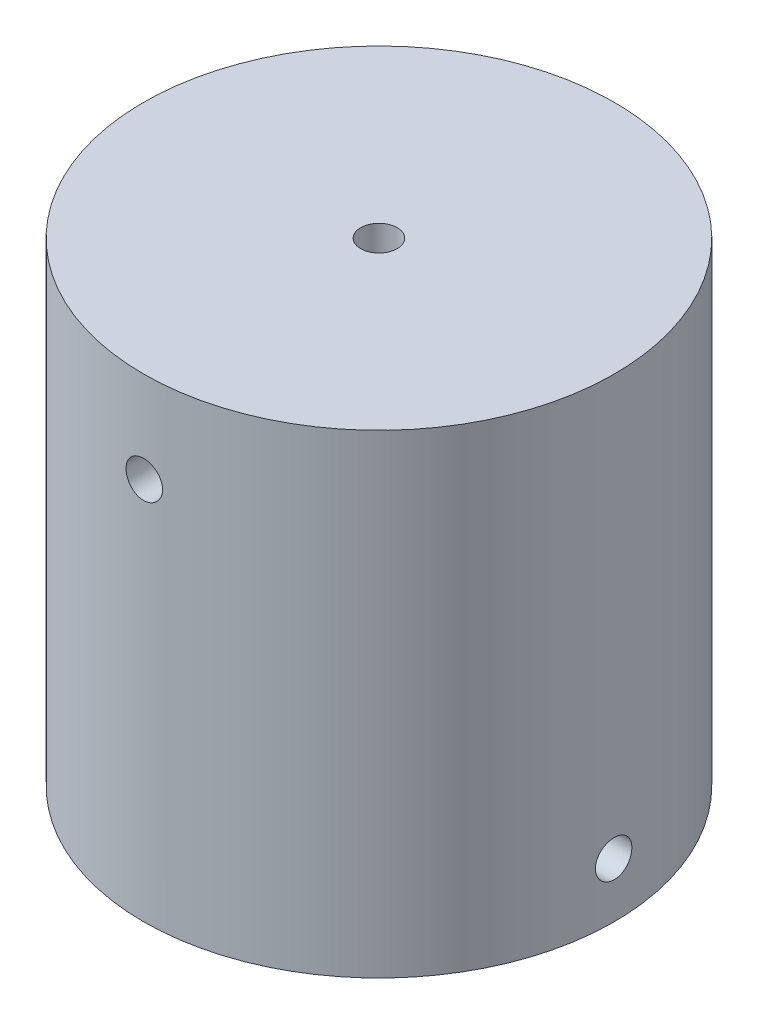
ISO-10303-21;
HEADER;
FILE_DESCRIPTION(('STEP AP214'),'2;1');
FILE_NAME('part.step','',(''),(''),'','','');
FILE_SCHEMA(('AUTOMOTIVE_DESIGN { 1 0 10303 214 1 1 1 1 }'));
ENDSEC;
DATA;
#1=APPLICATION_CONTEXT('core data for automotive mechanical design processes');
#2=APPLICATION_PROTOCOL_DEFINITION('international standard','automotive_design',2000,#1);
#3=PRODUCT_CONTEXT('',#1,'mechanical');
#4=PRODUCT('Part','Part','',(#3));
#5=PRODUCT_RELATED_PRODUCT_CATEGORY('part','',(#4));
#6=PRODUCT_DEFINITION_FORMATION('','',#4);
#7=PRODUCT_DEFINITION_CONTEXT('part definition',#1,'design');
#8=PRODUCT_DEFINITION('design','',#6,#7);
#9=PRODUCT_DEFINITION_SHAPE('','',#8);
#10=(LENGTH_UNIT() NAMED_UNIT(*) SI_UNIT(.MILLI.,.METRE.));
#11=(NAMED_UNIT(*) PLANE_ANGLE_UNIT() SI_UNIT($,.RADIAN.));
#12=(NAMED_UNIT(*) SI_UNIT($,.STERADIAN.) SOLID_ANGLE_UNIT());
#13=UNCERTAINTY_MEASURE_WITH_UNIT(LENGTH_MEASURE(1.E-05),#10,'distance_accuracy_value','');
#14=(GEOMETRIC_REPRESENTATION_CONTEXT(3) GLOBAL_UNCERTAINTY_ASSIGNED_CONTEXT((#13)) GLOBAL_UNIT_ASSIGNED_CONTEXT((#10,
#11,#12)) REPRESENTATION_CONTEXT('',''));
#15=CARTESIAN_POINT('',(0.,0.,0.));
#16=DIRECTION('',(0.,0.,1.));
#17=DIRECTION('',(1.,0.,0.));
#18=AXIS2_PLACEMENT_3D('',#15,#16,#17);
#19=CARTESIAN_POINT('',(-0.136395342844098,21.,19.));
#20=DIRECTION('',(0.,0.,-1.));
#21=DIRECTION('',(-1.,0.,0.));
#22=AXIS2_PLACEMENT_3D('',#19,#20,#21);
#23=CYLINDRICAL_SURFACE('',#22,1.);
#24=CARTESIAN_POINT('',(-0.136395342844098,22.,-13.0363953428441));
#25=CARTESIAN_POINT('',(-0.0803152332361181,21.9999975447057,-13.0363948326996));
#26=CARTESIAN_POINT('',(-0.0241966108510859,21.9952666686488,-13.0360257453348));
#27=CARTESIAN_POINT('',(0.0864889071586732,21.9764633856107,-13.0345888682643));
#28=CARTESIAN_POINT('',(0.141053955622765,21.9623803062138,-13.0335202803322));
#29=CARTESIAN_POINT('',(0.247013168612073,21.9252814636675,-13.0308051979077));
#30=CARTESIAN_POINT('',(0.298409071761981,21.9022706498127,-13.0291590236617));
#31=CARTESIAN_POINT('',(0.396596285295285,21.847978138086,-13.0254735438275));
#32=CARTESIAN_POINT('',(0.443388598912816,21.8166982477497,-13.0234343241813));
#33=CARTESIAN_POINT('',(0.531157167554613,21.7466800771037,-13.0191866247445));
#34=CARTESIAN_POINT('',(0.572121776281206,21.7079272165223,-13.0169778192357));
#35=CARTESIAN_POINT('',(0.646972251331752,21.62409380517,-13.0126426404393));
#36=CARTESIAN_POINT('',(0.680857811475169,21.5790129808451,-13.0105162707206));
#37=CARTESIAN_POINT('',(0.740626918432395,21.4837338473458,-13.0065831224504));
#38=CARTESIAN_POINT('',(0.766500359253793,21.4335291804845,-13.0047767487407));
#39=CARTESIAN_POINT('',(0.809446199109227,21.3294718696206,-13.0016916882172));
#40=CARTESIAN_POINT('',(0.826518734794541,21.2756192822738,-13.0004129932104));
#41=CARTESIAN_POINT('',(0.851344688484866,21.165910513099,-12.9985306995076));
#42=CARTESIAN_POINT('',(0.859116920001003,21.110058612335,-12.997925738094));
#43=CARTESIAN_POINT('',(0.865179748366765,20.9978399524041,-12.9974550602932));
#44=CARTESIAN_POINT('',(0.863470501410903,20.9414732017339,-12.9975893317282));
#45=CARTESIAN_POINT('',(0.850634457262089,20.8299535871415,-12.9985807140469));
#46=CARTESIAN_POINT('',(0.83952807874051,20.7747983571293,-12.999436257691));
#47=CARTESIAN_POINT('',(0.808244747806519,20.6671373137186,-13.0017713206089));
#48=CARTESIAN_POINT('',(0.78806771729115,20.6146315231376,-13.0032508452554));
#49=CARTESIAN_POINT('',(0.73919287400951,20.513694567662,-13.0066689614984));
#50=CARTESIAN_POINT('',(0.710485869047275,20.4652678711696,-13.0086080478758));
#51=CARTESIAN_POINT('',(0.645372598924702,20.3739126190503,-13.0127263235639));
#52=CARTESIAN_POINT('',(0.608966199153452,20.3309841595718,-13.0149055170722));
#53=CARTESIAN_POINT('',(0.529372913770601,20.2517252163692,-13.0192654243875));
#54=CARTESIAN_POINT('',(0.486168370261759,20.2154124620483,-13.0214461270032));
#55=CARTESIAN_POINT('',(0.394266910216951,20.1505526940887,-13.0255578322737));
#56=CARTESIAN_POINT('',(0.345569990626743,20.1220056847684,-13.0274888347896));
#57=CARTESIAN_POINT('',(0.24405481671609,20.0734889765333,-13.0308838593946));
#58=CARTESIAN_POINT('',(0.191236202386282,20.0535200278622,-13.0323478406349));
#59=CARTESIAN_POINT('',(0.0829821037602164,20.0227385230712,-13.0346433785708));
#60=CARTESIAN_POINT('',(0.0275466664758458,20.0119258025234,-13.0354749466234));
#61=CARTESIAN_POINT('',(-0.0842137488916121,19.9997858358059,-13.0364105024993));
#62=CARTESIAN_POINT('',(-0.140536051031293,19.9984340934579,-13.0365163692793));
#63=CARTESIAN_POINT('',(-0.252606507460737,20.0051903339824,-13.0359936060974));
#64=CARTESIAN_POINT('',(-0.308354666371412,20.0132982406602,-13.0353649820514));
#65=CARTESIAN_POINT('',(-0.417624763310624,20.0387233285462,-13.0334451632814));
#66=CARTESIAN_POINT('',(-0.471149350539905,20.0560291908851,-13.0321547829732));
#67=CARTESIAN_POINT('',(-0.574534910418843,20.0993474000396,-13.0290564732359));
#68=CARTESIAN_POINT('',(-0.624395832725355,20.125359866467,-13.0272485366966));
#69=CARTESIAN_POINT('',(-0.719150388678294,20.1854146909677,-13.0233132435947));
#70=CARTESIAN_POINT('',(-0.7640336839546,20.2194733180885,-13.0211852430839));
#71=CARTESIAN_POINT('',(-0.847454642579692,20.2946301086616,-13.016851193973));
#72=CARTESIAN_POINT('',(-0.88599221047171,20.3357283779899,-13.0146451441995));
#73=CARTESIAN_POINT('',(-0.955711480553649,20.4239039362816,-13.0103981032177));
#74=CARTESIAN_POINT('',(-0.9868772260289,20.4709938619737,-13.0083574762351));
#75=CARTESIAN_POINT('',(-1.04085884337218,20.5697529388207,-13.0046773167606));
#76=CARTESIAN_POINT('',(-1.06367478892337,20.6214220495614,-13.0030377807293));
#77=CARTESIAN_POINT('',(-1.1002818242857,20.7278157523368,-13.0003473681603));
#78=CARTESIAN_POINT('',(-1.11408276645105,20.7825369375518,-12.9992958491697));
#79=CARTESIAN_POINT('',(-1.13230014570974,20.8935283103594,-12.9978983034417));
#80=CARTESIAN_POINT('',(-1.13671673607623,20.9497984726377,-12.9975522651818));
#81=CARTESIAN_POINT('',(-1.13603837121788,21.0621319065934,-12.9976049973424));
#82=CARTESIAN_POINT('',(-1.13096849090188,21.1181953323271,-12.9980018042548));
#83=CARTESIAN_POINT('',(-1.1115132954989,21.2286720310466,-12.9994913475903));
#84=CARTESIAN_POINT('',(-1.09712796527031,21.2830853013502,-13.0005840851445));
#85=CARTESIAN_POINT('',(-1.05945637324309,21.38871933809,-13.0033418548183));
#86=CARTESIAN_POINT('',(-1.03617046660982,21.4399402318188,-13.0050068641017));
#87=CARTESIAN_POINT('',(-0.981361663554901,21.5377495410261,-13.0087215919382));
#88=CARTESIAN_POINT('',(-0.949838922152401,21.5843380436645,-13.010771303251));
#89=CARTESIAN_POINT('',(-0.879357254116927,21.6716882177453,-13.015030894475));
#90=CARTESIAN_POINT('',(-0.840379843680324,21.7124349556931,-13.017241163858));
#91=CARTESIAN_POINT('',(-0.7561270880714,21.7868232941973,-13.0215693017286));
#92=CARTESIAN_POINT('',(-0.710850216247462,21.8204631674389,-13.0236871476538));
#93=CARTESIAN_POINT('',(-0.615207679216994,21.8797215866007,-13.0275951189218));
#94=CARTESIAN_POINT('',(-0.564833660905427,21.9053266742305,-13.0293846923467));
#95=CARTESIAN_POINT('',(-0.460522623873897,21.947683048138,-13.0324277864571));
#96=CARTESIAN_POINT('',(-0.406589806262112,21.9644445709552,-13.0336819265911));
#97=CARTESIAN_POINT('',(-0.316345147534166,21.9843421286959,-13.0351888204152));
#98=CARTESIAN_POINT('',(-0.280614642926495,21.9902060917073,-13.0356392217386));
#99=CARTESIAN_POINT('',(-0.208726547188154,21.9980358148605,-13.0362426471499));
#100=CARTESIAN_POINT('',(-0.17256895701605,22.0000015837499,-13.036395671905));
#101=CARTESIAN_POINT('',(-0.136395342844098,22.,-13.0363953428441));
#102=B_SPLINE_CURVE_WITH_KNOTS('',3,(#24,#25,#26,#27,#28,#29,#30,#31,#32,#33,#34,#35,#36,#37,
#38,#39,#40,#41,#42,#43,#44,#45,#46,#47,#48,#49,#50,#51,#52,#53,#54,#55,#56,#57,#58,#59,#60,#61,
#62,#63,#64,#65,#66,#67,#68,#69,#70,#71,#72,#73,#74,#75,#76,#77,#78,#79,#80,#81,#82,#83,#84,#85,
#86,#87,#88,#89,#90,#91,#92,#93,#94,#95,#96,#97,#98,#99,#100,#101),.UNSPECIFIED.,.T.,.F.,(4,2,2,
2,2,2,2,2,2,2,2,2,2,2,2,2,2,2,2,2,2,2,2,2,2,2,2,2,2,2,2,2,2,2,2,2,2,2,4),(0.,0.168108261240521,
0.33640869232054,0.504615955200747,0.672786480051541,0.841288498868165,1.00979780416706,
1.17851879899308,1.34723717401654,1.51561366987213,1.6839873919613,1.85199619793114,
2.02000645057055,2.18819841759252,2.35639332541008,2.52503255250882,2.6936718733862,
2.86232594058516,3.03097697902337,3.19919118743986,3.36740404094815,3.5354103718372,
3.70341901090289,3.87177030961171,4.04012414054453,4.20883911440503,4.37755259939722,
4.54608139023078,4.71460742848872,4.88268864307775,5.05077013087177,5.21884491230319,
5.38691653075592,5.5554104148427,5.72394520416888,5.89276080125204,6.06138056102953,
6.16981645870822,6.27825211305593),.UNSPECIFIED.);
#103=CARTESIAN_POINT('',(-0.136395342844098,22.,-13.0363953428441));
#104=VERTEX_POINT('',#103);
#105=EDGE_CURVE('E120',#104,#104,#102,.T.);
#106=ORIENTED_EDGE('',*,*,#105,.T.);
#107=EDGE_LOOP('',(#106));
#108=FACE_BOUND('',#107,.T.);
#109=CARTESIAN_POINT('',(-0.136395342844098,21.,-0.136395342844098));
#110=DIRECTION('',(0.,0.707106781186547,0.707106781186547));
#111=DIRECTION('',(0.,0.707106781186547,-0.707106781186547));
#112=AXIS2_PLACEMENT_3D('',#109,#110,#111);
#113=ELLIPSE('',#112,1.41421356237309,1.);
#114=CARTESIAN_POINT('',(0.863604657155902,21.,-0.136395342844098));
#115=VERTEX_POINT('',#114);
#116=CARTESIAN_POINT('',(-1.1363953428441,21.,-0.136395342844098));
#117=VERTEX_POINT('',#116);
#118=EDGE_CURVE('E99',#115,#117,#113,.T.);
#119=ORIENTED_EDGE('',*,*,#118,.T.);
#120=CARTESIAN_POINT('',(-0.136395342844098,21.,-0.136395342844098));
#121=DIRECTION('',(0.,0.707106781186547,-0.707106781186547));
#122=DIRECTION('',(0.,-0.707106781186547,-0.707106781186547));
#123=AXIS2_PLACEMENT_3D('',#120,#121,#122);
#124=ELLIPSE('',#123,1.41421356237309,1.);
#125=EDGE_CURVE('E11',#117,#115,#124,.F.);
#126=ORIENTED_EDGE('',*,*,#125,.T.);
#127=EDGE_LOOP('',(#119,#126));
#128=FACE_BOUND('',#127,.T.);
#129=ADVANCED_FACE('F46',(#108,#128),#23,.F.);
#130=CARTESIAN_POINT('',(-1.1363953428441,21.,12.7247865624086));
#131=CARTESIAN_POINT('',(-1.13639288729213,20.9439201758604,12.7247870782888));
#132=CARTESIAN_POINT('',(-1.13166205777024,20.8878018380061,12.7251573050952));
#133=CARTESIAN_POINT('',(-1.11285897638371,20.7771169111963,12.726598253135));
#134=CARTESIAN_POINT('',(-1.09877605112703,20.7225521696245,12.7276697747244));
#135=CARTESIAN_POINT('',(-1.06167765952414,20.6165936054514,12.7303912220786));
#136=CARTESIAN_POINT('',(-1.03866714981449,20.5651980416264,12.7320408268398));
#137=CARTESIAN_POINT('',(-0.984375354242625,20.4670113962213,12.7357321676687));
#138=CARTESIAN_POINT('',(-0.953095875165025,20.4202193118338,12.7377738180471));
#139=CARTESIAN_POINT('',(-0.883078119215958,20.3324504825893,12.7420243490478));
#140=CARTESIAN_POINT('',(-0.84432517026422,20.2914854570558,12.7442335533524));
#141=CARTESIAN_POINT('',(-0.760491407403222,20.2166341780661,12.7485672935757));
#142=CARTESIAN_POINT('',(-0.71541032107455,20.1827482295128,12.7506918258444));
#143=CARTESIAN_POINT('',(-0.620130959762319,20.1229787177698,12.7546198462318));
#144=CARTESIAN_POINT('',(-0.569926372132696,20.0971051888544,12.7564229305995));
#145=CARTESIAN_POINT('',(-0.465869233524715,20.054159164249,12.7595014252342));
#146=CARTESIAN_POINT('',(-0.412016738764101,20.0370865329636,12.7607768436308));
#147=CARTESIAN_POINT('',(-0.302308245938753,20.0122603774699,12.7626540444232));
#148=CARTESIAN_POINT('',(-0.246456530599302,20.0044880320846,12.7632571871468));
#149=CARTESIAN_POINT('',(-0.134238233199238,19.9984249117433,12.7637264810224));
#150=CARTESIAN_POINT('',(-0.0778716595692401,20.0001339818094,12.7635926442207));
#151=CARTESIAN_POINT('',(0.0336487391893078,20.0129697474112,12.7626041848473));
#152=CARTESIAN_POINT('',(0.0888049096135024,20.0240762022939,12.7617511114247));
#153=CARTESIAN_POINT('',(0.196467794475457,20.0553600125139,12.7594219396492));
#154=CARTESIAN_POINT('',(0.248974486596967,20.0755374442406,12.7579458360494));
#155=CARTESIAN_POINT('',(0.349912529053278,20.1244131151374,12.7545340410129));
#156=CARTESIAN_POINT('',(0.398339456727464,20.1531204523774,12.7525978592967));
#157=CARTESIAN_POINT('',(0.489695029991397,20.218234430014,12.7484835917485));
#158=CARTESIAN_POINT('',(0.532623579296028,20.2546412052101,12.7463055016815));
#159=CARTESIAN_POINT('',(0.611882092791731,20.3342347550148,12.741945543599));
#160=CARTESIAN_POINT('',(0.648194403543742,20.3774391113504,12.7397636807157));
#161=CARTESIAN_POINT('',(0.713053366003086,20.4693400395434,12.7356478685064));
#162=CARTESIAN_POINT('',(0.741600012488559,20.5180366150939,12.7337139193472));
#163=CARTESIAN_POINT('',(0.790116460411316,20.6195516997922,12.7303124847917));
#164=CARTESIAN_POINT('',(0.810085398860456,20.6723706230508,12.7288450463341));
#165=CARTESIAN_POINT('',(0.840866788364138,20.7806253925743,12.7265436315421));
#166=CARTESIAN_POINT('',(0.851679405696903,20.8360611912975,12.7257096437044));
#167=CARTESIAN_POINT('',(0.863818983706631,20.9478217684505,12.7247713627958));
#168=CARTESIAN_POINT('',(0.865170538113134,21.0041438602732,12.7246651778398));
#169=CARTESIAN_POINT('',(0.858413996790125,21.1162138507762,12.7251895288892));
#170=CARTESIAN_POINT('',(0.850305977248551,21.1719617540775,12.7258200589611));
#171=CARTESIAN_POINT('',(0.824880925275509,21.281230611737,12.7277450664745));
#172=CARTESIAN_POINT('',(0.807575323791273,21.3347542416366,12.7290387197019));
#173=CARTESIAN_POINT('',(0.764257957366074,21.4381380024325,12.7321435180607));
#174=CARTESIAN_POINT('',(0.738246071282011,21.4879980823409,12.7339546703928));
#175=CARTESIAN_POINT('',(0.678192095442974,21.5827520740849,12.7378949768874));
#176=CARTESIAN_POINT('',(0.644133589077993,21.6276355539659,12.7400247778511));
#177=CARTESIAN_POINT('',(0.568976934220684,21.7110569413944,12.7443601890705));
#178=CARTESIAN_POINT('',(0.527878680734278,21.7495947542827,12.7465658004566));
#179=CARTESIAN_POINT('',(0.439703013478835,21.8193145398753,12.7508099151829));
#180=CARTESIAN_POINT('',(0.392612960566254,21.8504805531799,12.7528480498389));
#181=CARTESIAN_POINT('',(0.293853559181999,21.9044626407211,12.7565222603038));
#182=CARTESIAN_POINT('',(0.242184251149903,21.9272787886866,12.7581583396627));
#183=CARTESIAN_POINT('',(0.135790684198835,21.9638859609947,12.760842384226));
#184=CARTESIAN_POINT('',(0.0810698623587175,21.9776869253367,12.7618909969795));
#185=CARTESIAN_POINT('',(-0.0299207452088553,21.9959044721266,12.7632845744682));
#186=CARTESIAN_POINT('',(-0.0861905059414864,22.0003212059155,12.763629550551));
#187=CARTESIAN_POINT('',(-0.198524197168811,21.9996432535563,12.7635770086901));
#188=CARTESIAN_POINT('',(-0.254588280554434,21.9945734704433,12.7631814347613));
#189=CARTESIAN_POINT('',(-0.365066318503488,21.9751182378202,12.7616960963824));
#190=CARTESIAN_POINT('',(-0.419480270592061,21.9607327743394,12.7606063308911));
#191=CARTESIAN_POINT('',(-0.525115652947131,21.9230606650785,12.7578549445451));
#192=CARTESIAN_POINT('',(-0.576337209363199,21.8997743712803,12.7561933463036));
#193=CARTESIAN_POINT('',(-0.67414768196258,21.8449645892128,12.7524843909221));
#194=CARTESIAN_POINT('',(-0.720736685714851,21.8134412566888,12.750437041076));
#195=CARTESIAN_POINT('',(-0.808086814896227,21.7429589450627,12.7461801360018));
#196=CARTESIAN_POINT('',(-0.848833115274007,21.7039816168887,12.7439701889547));
#197=CARTESIAN_POINT('',(-0.923220609431587,21.6197292049276,12.7396404722475));
#198=CARTESIAN_POINT('',(-0.956860074759843,21.5744525935239,12.7375207246246));
#199=CARTESIAN_POINT('',(-1.01611806243753,21.4788102620408,12.7336075345965));
#200=CARTESIAN_POINT('',(-1.0417230512314,21.4284361422469,12.7318146448677));
#201=CARTESIAN_POINT('',(-1.08407921211138,21.3241248886401,12.7287649910561));
#202=CARTESIAN_POINT('',(-1.10084062218098,21.2701919565481,12.7275076073585));
#203=CARTESIAN_POINT('',(-1.1207378572672,21.1799476003189,12.7259966099177));
#204=CARTESIAN_POINT('',(-1.12660167515409,21.1442175355147,12.7255449100156));
#205=CARTESIAN_POINT('',(-1.13443120547559,21.0723303212152,12.7249397202201));
#206=CARTESIAN_POINT('',(-1.13639692674895,21.0361731726886,12.7247862296504));
#207=CARTESIAN_POINT('',(-1.1363953428441,21.,12.7247865624086));
#208=B_SPLINE_CURVE_WITH_KNOTS('',3,(#130,#131,#132,#133,#134,#135,#136,#137,#138,#139,#140,
#141,#142,#143,#144,#145,#146,#147,#148,#149,#150,#151,#152,#153,#154,#155,#156,#157,#158,#159,
#160,#161,#162,#163,#164,#165,#166,#167,#168,#169,#170,#171,#172,#173,#174,#175,#176,#177,#178,
#179,#180,#181,#182,#183,#184,#185,#186,#187,#188,#189,#190,#191,#192,#193,#194,#195,#196,#197,
#198,#199,#200,#201,#202,#203,#204,#205,#206,#207),.UNSPECIFIED.,.T.,.F.,(4,2,2,2,2,2,2,2,2,2,2,
2,2,2,2,2,2,2,2,2,2,2,2,2,2,2,2,2,2,2,2,2,2,2,2,2,2,2,4),(0.,0.16810740383748,0.336406996360484,
0.50461328157218,0.672782843743995,0.841285984385069,1.00979638112838,1.17851696465661,
1.34723494863022,1.51561091400583,1.68398412721212,1.85199560851863,2.02000850473029,
2.1882012521727,2.3563969445279,2.52503504645913,2.69367326178729,2.86232843953863,
3.03098055445672,3.19919410026683,3.367406291285,3.53540991186525,3.70341587021948,
3.87176759799674,4.04012183686899,4.20883728084621,4.37755123503927,4.54607885248706,
4.71460375204086,4.88268687776641,5.05077025556985,5.21884698723373,5.38692054114562,
5.55541328540803,5.72394696169216,5.89276301676245,6.06138320662149,6.16981778235169,
6.27825211221168),.UNSPECIFIED.);
#209=CARTESIAN_POINT('',(-1.1363953428441,21.,12.7247865624086));
#210=VERTEX_POINT('',#209);
#211=EDGE_CURVE('E104',#210,#210,#208,.T.);
#212=ORIENTED_EDGE('',*,*,#211,.T.);
#213=EDGE_LOOP('',(#212));
#214=FACE_BOUND('',#213,.T.);
#215=CARTESIAN_POINT('',(-0.136395342844098,21.,-0.136395342844098));
#216=DIRECTION('',(0.,0.707106781186547,-0.707106781186547));
#217=DIRECTION('',(0.,0.707106781186547,0.707106781186547));
#218=AXIS2_PLACEMENT_3D('',#215,#216,#217);
#219=ELLIPSE('',#218,1.41421356237309,1.);
#220=EDGE_CURVE('E101',#117,#115,#219,.T.);
#221=ORIENTED_EDGE('',*,*,#220,.T.);
#222=CARTESIAN_POINT('',(-0.136395342844098,21.,-0.136395342844098));
#223=DIRECTION('',(0.,-0.707106781186547,-0.707106781186547));
#224=DIRECTION('',(0.,0.707106781186547,-0.707106781186547));
#225=AXIS2_PLACEMENT_3D('',#222,#223,#224);
#226=ELLIPSE('',#225,1.41421356237309,1.);
#227=EDGE_CURVE('E55',#115,#117,#226,.T.);
#228=ORIENTED_EDGE('',*,*,#227,.T.);
#229=EDGE_LOOP('',(#221,#228));
#230=FACE_BOUND('',#229,.T.);
#231=ADVANCED_FACE('F102',(#214,#230),#23,.F.);
#232=CARTESIAN_POINT('',(-0.136395342844098,6.,-0.136395342844098));
#233=DIRECTION('',(0.,-1.,0.));
#234=DIRECTION('',(0.,0.,-1.));
#235=AXIS2_PLACEMENT_3D('',#232,#233,#234);
#236=CYLINDRICAL_SURFACE('',#235,12.9);
#237=CARTESIAN_POINT('',(-0.136395342844098,0.,-0.136395342844098));
#238=DIRECTION('',(0.,1.,0.));
#239=DIRECTION('',(0.,0.,1.));
#240=AXIS2_PLACEMENT_3D('',#237,#238,#239);
#241=CIRCLE('',#240,12.9);
#242=CARTESIAN_POINT('',(-0.136395342844098,0.,12.7636046571559));
#243=VERTEX_POINT('',#242);
#244=EDGE_CURVE('E96',#243,#243,#241,.T.);
#245=ORIENTED_EDGE('',*,*,#244,.T.);
#246=EDGE_LOOP('',(#245));
#247=FACE_BOUND('',#246,.T.);
#248=CARTESIAN_POINT('',(-0.136395342844098,26.,-0.136395342844098));
#249=DIRECTION('',(0.,1.,0.));
#250=DIRECTION('',(0.,0.,1.));
#251=AXIS2_PLACEMENT_3D('',#248,#249,#250);
#252=CIRCLE('',#251,12.9);
#253=CARTESIAN_POINT('',(-0.136395342844098,26.,12.7636046571559));
#254=VERTEX_POINT('',#253);
#255=EDGE_CURVE('E156',#254,#254,#252,.T.);
#256=ORIENTED_EDGE('',*,*,#255,.F.);
#257=EDGE_LOOP('',(#256));
#258=FACE_BOUND('',#257,.T.);
#259=CARTESIAN_POINT('',(-12.9975772480968,3.,0.863604657155902));
#260=CARTESIAN_POINT('',(-12.997577763977,3.05607982413962,0.863602201603931));
#261=CARTESIAN_POINT('',(-12.9979479907834,3.11219816199392,0.858871372082042));
#262=CARTESIAN_POINT('',(-12.9993889388232,3.22288308880371,0.840068290695509));
#263=CARTESIAN_POINT('',(-13.0004604604126,3.27744783037549,0.82598536543883));
#264=CARTESIAN_POINT('',(-13.0031819077668,3.38340639454856,0.788886973835947));
#265=CARTESIAN_POINT('',(-13.004831512528,3.43480195837363,0.765876464126293));
#266=CARTESIAN_POINT('',(-13.0085228533569,3.5329886037787,0.711584668554428));
#267=CARTESIAN_POINT('',(-13.0105645037353,3.57978068816622,0.680305189476828));
#268=CARTESIAN_POINT('',(-13.014815034736,3.66754951741068,0.610287433527761));
#269=CARTESIAN_POINT('',(-13.0170242390406,3.70851454294419,0.571534484576024));
#270=CARTESIAN_POINT('',(-13.0213579792639,3.78336582193388,0.487700721715025));
#271=CARTESIAN_POINT('',(-13.0234825115326,3.81725177048717,0.442619635386353));
#272=CARTESIAN_POINT('',(-13.02741053192,3.87702128223021,0.347340274074121));
#273=CARTESIAN_POINT('',(-13.0292136162877,3.90289481114561,0.2971356864445));
#274=CARTESIAN_POINT('',(-13.0322921109224,3.94584083575101,0.193078547836518));
#275=CARTESIAN_POINT('',(-13.033567529319,3.96291346703639,0.139226053075903));
#276=CARTESIAN_POINT('',(-13.0354447301114,3.98773962253013,0.0295175602505541));
#277=CARTESIAN_POINT('',(-13.036047872835,3.99551196791539,-0.0263341550888966));
#278=CARTESIAN_POINT('',(-13.0365171667106,4.0015750882567,-0.13855245248896));
#279=CARTESIAN_POINT('',(-13.0363833299089,3.99986601819055,-0.194919026118958));
#280=CARTESIAN_POINT('',(-13.0353948705355,3.98703025258885,-0.306439424877506));
#281=CARTESIAN_POINT('',(-13.0345417971129,3.97592379770606,-0.361595595301701));
#282=CARTESIAN_POINT('',(-13.0322126253374,3.94463998748613,-0.469258480163655));
#283=CARTESIAN_POINT('',(-13.0307365217376,3.92446255575938,-0.521765172285165));
#284=CARTESIAN_POINT('',(-13.0273247267011,3.87558688486255,-0.622703214741476));
#285=CARTESIAN_POINT('',(-13.0253885449849,3.84687954762259,-0.671130142415662));
#286=CARTESIAN_POINT('',(-13.0212742774367,3.78176556998599,-0.762485715679595));
#287=CARTESIAN_POINT('',(-13.0190961873697,3.74535879478986,-0.805414264984225));
#288=CARTESIAN_POINT('',(-13.0147362292872,3.66576524498524,-0.884672778479928));
#289=CARTESIAN_POINT('',(-13.0125543664039,3.62256088864961,-0.920985089231939));
#290=CARTESIAN_POINT('',(-13.0084385541946,3.53065996045658,-0.985844051691283));
#291=CARTESIAN_POINT('',(-13.0065046050354,3.48196338490609,-1.01439069817676));
#292=CARTESIAN_POINT('',(-13.0031031704799,3.38044830020776,-1.06290714609951));
#293=CARTESIAN_POINT('',(-13.0016357320223,3.32762937694917,-1.08287608454865));
#294=CARTESIAN_POINT('',(-12.9993343172303,3.21937460742574,-1.11365747405233));
#295=CARTESIAN_POINT('',(-12.9985003293926,3.16393880870249,-1.1244700913851));
#296=CARTESIAN_POINT('',(-12.997562048484,3.05217823154947,-1.13660966939483));
#297=CARTESIAN_POINT('',(-12.997455863528,2.99585613972677,-1.13796122380133));
#298=CARTESIAN_POINT('',(-12.9979802145774,2.88378614922376,-1.13120468247832));
#299=CARTESIAN_POINT('',(-12.9986107446493,2.82803824592255,-1.12309666293675));
#300=CARTESIAN_POINT('',(-13.0005357521627,2.71876938826303,-1.09767161096371));
#301=CARTESIAN_POINT('',(-13.0018294053901,2.66524575836345,-1.08036600947947));
#302=CARTESIAN_POINT('',(-13.0049342037489,2.56186199756747,-1.03704864305427));
#303=CARTESIAN_POINT('',(-13.006745356081,2.51200191765911,-1.01103675697021));
#304=CARTESIAN_POINT('',(-13.0106856625756,2.41724792591512,-0.95098278113117));
#305=CARTESIAN_POINT('',(-13.0128154635393,2.37236444603407,-0.916924274766188));
#306=CARTESIAN_POINT('',(-13.0171508747587,2.28894305860564,-0.841767619908878));
#307=CARTESIAN_POINT('',(-13.0193564861448,2.25040524571731,-0.800669366422472));
#308=CARTESIAN_POINT('',(-13.0236006008711,2.18068546012466,-0.712493699167028));
#309=CARTESIAN_POINT('',(-13.0256387355271,2.14951944682007,-0.665403646254449));
#310=CARTESIAN_POINT('',(-13.029312945992,2.09553735927886,-0.566644244870195));
#311=CARTESIAN_POINT('',(-13.0309490253509,2.07272121131338,-0.514974936838099));
#312=CARTESIAN_POINT('',(-13.0336330699142,2.03611403900526,-0.408581369887032));
#313=CARTESIAN_POINT('',(-13.0346816826677,2.0223130746633,-0.353860548046914));
#314=CARTESIAN_POINT('',(-13.0360752601564,2.00409552787343,-0.24286994047934));
#315=CARTESIAN_POINT('',(-13.0364202362392,1.99967879408445,-0.186600179746709));
#316=CARTESIAN_POINT('',(-13.0363676943783,2.00035674644368,-0.0742664885193842));
#317=CARTESIAN_POINT('',(-13.0359721204495,2.00542652955674,-0.0182024051337616));
#318=CARTESIAN_POINT('',(-13.0344867820706,2.02488176217977,0.0922756328152934));
#319=CARTESIAN_POINT('',(-13.0333970165793,2.03926722566064,0.146689584903866));
#320=CARTESIAN_POINT('',(-13.0306456302333,2.0769393349215,0.252324967258937));
#321=CARTESIAN_POINT('',(-13.0289840319918,2.10022562871975,0.303546523675007));
#322=CARTESIAN_POINT('',(-13.0252750766103,2.15503541078723,0.401356996274388));
#323=CARTESIAN_POINT('',(-13.0232277267642,2.18655874331117,0.447946000026657));
#324=CARTESIAN_POINT('',(-13.01897082169,2.25704105493726,0.535296129208033));
#325=CARTESIAN_POINT('',(-13.0167608746429,2.29601838311127,0.576042429585813));
#326=CARTESIAN_POINT('',(-13.0124311579357,2.38027079507245,0.650429923743393));
#327=CARTESIAN_POINT('',(-13.0103114103128,2.4255474064761,0.684069389071649));
#328=CARTESIAN_POINT('',(-13.0063982202847,2.52118973795923,0.743327376749332));
#329=CARTESIAN_POINT('',(-13.0046053305559,2.57156385775315,0.768932365543204));
#330=CARTESIAN_POINT('',(-13.0015556767443,2.67587511135989,0.81128852642318));
#331=CARTESIAN_POINT('',(-13.0002982930467,2.7298080434519,0.828049936492787));
#332=CARTESIAN_POINT('',(-12.9987872956059,2.82005239968114,0.847947171579007));
#333=CARTESIAN_POINT('',(-12.9983355957038,2.85578246448534,0.853810989465891));
#334=CARTESIAN_POINT('',(-12.9977304059083,2.92766967878475,0.861640519787396));
#335=CARTESIAN_POINT('',(-12.9975769153386,2.9638268273114,0.863606241060753));
#336=CARTESIAN_POINT('',(-12.9975772480968,3.,0.863604657155902));
#337=B_SPLINE_CURVE_WITH_KNOTS('',3,(#259,#260,#261,#262,#263,#264,#265,#266,#267,#268,#269,
#270,#271,#272,#273,#274,#275,#276,#277,#278,#279,#280,#281,#282,#283,#284,#285,#286,#287,#288,
#289,#290,#291,#292,#293,#294,#295,#296,#297,#298,#299,#300,#301,#302,#303,#304,#305,#306,#307,
#308,#309,#310,#311,#312,#313,#314,#315,#316,#317,#318,#319,#320,#321,#322,#323,#324,#325,#326,
#327,#328,#329,#330,#331,#332,#333,#334,#335,#336),.UNSPECIFIED.,.T.,.F.,(4,2,2,2,2,2,2,2,2,2,2,
2,2,2,2,2,2,2,2,2,2,2,2,2,2,2,2,2,2,2,2,2,2,2,2,2,2,2,4),(0.,0.168107403837481,
0.336406996360485,0.504613281572185,0.672782843743997,0.841285984385069,1.00979638112838,
1.17851696465661,1.34723494863022,1.51561091400583,1.68398412721212,1.85199560851863,
2.02000850473029,2.1882012521727,2.35639694452791,2.52503504645913,2.69367326178729,
2.86232843953864,3.03098055445672,3.19919410026683,3.367406291285,3.53540991186525,
3.70341587021948,3.87176759799674,4.04012183686899,4.20883728084622,4.37755123503927,
4.54607885248706,4.71460375204087,4.88268687776642,5.05077025556986,5.21884698723374,
5.38692054114562,5.55541328540803,5.72394696169216,5.89276301676246,6.06138320662149,
6.16981778235169,6.27825211221168),.UNSPECIFIED.);
#338=CARTESIAN_POINT('',(-12.9975772480968,3.,0.863604657155902));
#339=VERTEX_POINT('',#338);
#340=EDGE_CURVE('E142',#339,#339,#337,.T.);
#341=ORIENTED_EDGE('',*,*,#340,.F.);
#342=EDGE_LOOP('',(#341));
#343=FACE_BOUND('',#342,.T.);
#344=CARTESIAN_POINT('',(12.7247865624086,3.,0.863604657155902));
#345=CARTESIAN_POINT('',(12.7247870782888,2.94392017586038,0.863602201603931));
#346=CARTESIAN_POINT('',(12.7251573050952,2.88780183800608,0.858871372082042));
#347=CARTESIAN_POINT('',(12.726598253135,2.77711691119629,0.840068290695509));
#348=CARTESIAN_POINT('',(12.7276697747244,2.72255216962451,0.82598536543883));
#349=CARTESIAN_POINT('',(12.7303912220786,2.61659360545144,0.788886973835947));
#350=CARTESIAN_POINT('',(12.7320408268398,2.56519804162637,0.765876464126293));
#351=CARTESIAN_POINT('',(12.7357321676687,2.4670113962213,0.711584668554428));
#352=CARTESIAN_POINT('',(12.7377738180471,2.42021931183378,0.680305189476828));
#353=CARTESIAN_POINT('',(12.7420243490478,2.33245048258932,0.610287433527761));
#354=CARTESIAN_POINT('',(12.7442335533524,2.29148545705581,0.571534484576024));
#355=CARTESIAN_POINT('',(12.7485672935757,2.21663417806612,0.487700721715025));
#356=CARTESIAN_POINT('',(12.7506918258444,2.18274822951283,0.442619635386353));
#357=CARTESIAN_POINT('',(12.7546198462318,2.12297871776979,0.347340274074122));
#358=CARTESIAN_POINT('',(12.7564229305995,2.09710518885439,0.2971356864445));
#359=CARTESIAN_POINT('',(12.7595014252342,2.05415916424899,0.193078547836518));
#360=CARTESIAN_POINT('',(12.7607768436308,2.03708653296361,0.139226053075903));
#361=CARTESIAN_POINT('',(12.7626540444232,2.01226037746987,0.0295175602505538));
#362=CARTESIAN_POINT('',(12.7632571871468,2.00448803208461,-0.0263341550888968));
#363=CARTESIAN_POINT('',(12.7637264810224,1.9984249117433,-0.13855245248896));
#364=CARTESIAN_POINT('',(12.7635926442207,2.00013398180944,-0.194919026118958));
#365=CARTESIAN_POINT('',(12.7626041848473,2.01296974741115,-0.306439424877506));
#366=CARTESIAN_POINT('',(12.7617511114247,2.02407620229394,-0.361595595301701));
#367=CARTESIAN_POINT('',(12.7594219396492,2.05536001251387,-0.469258480163655));
#368=CARTESIAN_POINT('',(12.7579458360494,2.07553744424062,-0.521765172285165));
#369=CARTESIAN_POINT('',(12.7545340410129,2.12441311513745,-0.622703214741476));
#370=CARTESIAN_POINT('',(12.7525978592967,2.15312045237741,-0.671130142415662));
#371=CARTESIAN_POINT('',(12.7484835917485,2.21823443001401,-0.762485715679595));
#372=CARTESIAN_POINT('',(12.7463055016815,2.25464120521014,-0.805414264984225));
#373=CARTESIAN_POINT('',(12.741945543599,2.33423475501476,-0.884672778479928));
#374=CARTESIAN_POINT('',(12.7397636807157,2.37743911135039,-0.920985089231939));
#375=CARTESIAN_POINT('',(12.7356478685064,2.46934003954342,-0.985844051691284));
#376=CARTESIAN_POINT('',(12.7337139193472,2.51803661509391,-1.01439069817676));
#377=CARTESIAN_POINT('',(12.7303124847917,2.61955169979224,-1.06290714609951));
#378=CARTESIAN_POINT('',(12.7288450463341,2.67237062305083,-1.08287608454865));
#379=CARTESIAN_POINT('',(12.7265436315421,2.78062539257426,-1.11365747405233));
#380=CARTESIAN_POINT('',(12.7257096437044,2.83606119129751,-1.1244700913851));
#381=CARTESIAN_POINT('',(12.7247713627958,2.94782176845053,-1.13660966939483));
#382=CARTESIAN_POINT('',(12.7246651778398,3.00414386027323,-1.13796122380133));
#383=CARTESIAN_POINT('',(12.7251895288892,3.11621385077624,-1.13120468247832));
#384=CARTESIAN_POINT('',(12.7258200589611,3.17196175407746,-1.12309666293675));
#385=CARTESIAN_POINT('',(12.7277450664745,3.28123061173697,-1.09767161096371));
#386=CARTESIAN_POINT('',(12.7290387197019,3.33475424163655,-1.08036600947947));
#387=CARTESIAN_POINT('',(12.7321435180607,3.43813800243253,-1.03704864305427));
#388=CARTESIAN_POINT('',(12.7339546703928,3.48799808234089,-1.01103675697021));
#389=CARTESIAN_POINT('',(12.7378949768874,3.58275207408488,-0.95098278113117));
#390=CARTESIAN_POINT('',(12.7400247778511,3.62763555396593,-0.916924274766188));
#391=CARTESIAN_POINT('',(12.7443601890705,3.71105694139436,-0.841767619908878));
#392=CARTESIAN_POINT('',(12.7465658004566,3.74959475428269,-0.800669366422472));
#393=CARTESIAN_POINT('',(12.7508099151829,3.81931453987534,-0.712493699167028));
#394=CARTESIAN_POINT('',(12.7528480498389,3.85048055317993,-0.665403646254449));
#395=CARTESIAN_POINT('',(12.7565222603038,3.90446264072114,-0.566644244870195));
#396=CARTESIAN_POINT('',(12.7581583396627,3.92727878868662,-0.514974936838099));
#397=CARTESIAN_POINT('',(12.760842384226,3.96388596099474,-0.408581369887032));
#398=CARTESIAN_POINT('',(12.7618909969795,3.9776869253367,-0.353860548046914));
#399=CARTESIAN_POINT('',(12.7632845744682,3.99590447212657,-0.24286994047934));
#400=CARTESIAN_POINT('',(12.763629550551,4.00032120591555,-0.186600179746709));
#401=CARTESIAN_POINT('',(12.7635770086901,3.99964325355632,-0.0742664885193842));
#402=CARTESIAN_POINT('',(12.7631814347613,3.99457347044326,-0.0182024051337618));
#403=CARTESIAN_POINT('',(12.7616960963824,3.97511823782023,0.0922756328152931));
#404=CARTESIAN_POINT('',(12.7606063308911,3.96073277433936,0.146689584903866));
#405=CARTESIAN_POINT('',(12.7578549445451,3.9230606650785,0.252324967258937));
#406=CARTESIAN_POINT('',(12.7561933463036,3.89977437128025,0.303546523675007));
#407=CARTESIAN_POINT('',(12.7524843909221,3.84496458921277,0.401356996274388));
#408=CARTESIAN_POINT('',(12.750437041076,3.81344125668883,0.447946000026657));
#409=CARTESIAN_POINT('',(12.7461801360018,3.74295894506274,0.535296129208033));
#410=CARTESIAN_POINT('',(12.7439701889547,3.70398161688873,0.576042429585813));
#411=CARTESIAN_POINT('',(12.7396404722475,3.61972920492756,0.650429923743393));
#412=CARTESIAN_POINT('',(12.7375207246246,3.5744525935239,0.684069389071649));
#413=CARTESIAN_POINT('',(12.7336075345965,3.47881026204077,0.743327376749332));
#414=CARTESIAN_POINT('',(12.7318146448677,3.42843614224685,0.768932365543204));
#415=CARTESIAN_POINT('',(12.7287649910561,3.32412488864011,0.81128852642318));
#416=CARTESIAN_POINT('',(12.7275076073585,3.2701919565481,0.828049936492788));
#417=CARTESIAN_POINT('',(12.7259966099177,3.17994760031886,0.847947171579006));
#418=CARTESIAN_POINT('',(12.7255449100156,3.14421753551466,0.853810989465891));
#419=CARTESIAN_POINT('',(12.7249397202201,3.07233032121525,0.861640519787396));
#420=CARTESIAN_POINT('',(12.7247862296504,3.0361731726886,0.863606241060753));
#421=CARTESIAN_POINT('',(12.7247865624086,3.,0.863604657155902));
#422=B_SPLINE_CURVE_WITH_KNOTS('',3,(#344,#345,#346,#347,#348,#349,#350,#351,#352,#353,#354,
#355,#356,#357,#358,#359,#360,#361,#362,#363,#364,#365,#366,#367,#368,#369,#370,#371,#372,#373,
#374,#375,#376,#377,#378,#379,#380,#381,#382,#383,#384,#385,#386,#387,#388,#389,#390,#391,#392,
#393,#394,#395,#396,#397,#398,#399,#400,#401,#402,#403,#404,#405,#406,#407,#408,#409,#410,#411,
#412,#413,#414,#415,#416,#417,#418,#419,#420,#421),.UNSPECIFIED.,.T.,.F.,(4,2,2,2,2,2,2,2,2,2,2,
2,2,2,2,2,2,2,2,2,2,2,2,2,2,2,2,2,2,2,2,2,2,2,2,2,2,2,4),(0.,0.168107403837481,
0.336406996360485,0.504613281572185,0.672782843743997,0.841285984385069,1.00979638112838,
1.17851696465661,1.34723494863022,1.51561091400583,1.68398412721212,1.85199560851863,
2.02000850473029,2.1882012521727,2.35639694452791,2.52503504645913,2.69367326178729,
2.86232843953864,3.03098055445673,3.19919410026683,3.367406291285,3.53540991186525,
3.70341587021948,3.87176759799674,4.04012183686899,4.20883728084622,4.37755123503927,
4.54607885248706,4.71460375204087,4.88268687776642,5.05077025556986,5.21884698723374,
5.38692054114562,5.55541328540803,5.72394696169216,5.89276301676246,6.06138320662149,
6.16981778235169,6.27825211221168),.UNSPECIFIED.);
#423=CARTESIAN_POINT('',(12.7247865624086,3.,0.863604657155902));
#424=VERTEX_POINT('',#423);
#425=EDGE_CURVE('E147',#424,#424,#422,.T.);
#426=ORIENTED_EDGE('',*,*,#425,.F.);
#427=EDGE_LOOP('',(#426));
#428=FACE_BOUND('',#427,.T.);
#429=ORIENTED_EDGE('',*,*,#211,.F.);
#430=EDGE_LOOP('',(#429));
#431=FACE_BOUND('',#430,.T.);
#432=ORIENTED_EDGE('',*,*,#105,.F.);
#433=EDGE_LOOP('',(#432));
#434=FACE_BOUND('',#433,.T.);
#435=ADVANCED_FACE('F48',(#247,#258,#343,#428,#431,#434),#236,.T.);
#436=CARTESIAN_POINT('',(-0.136395342844098,21.,-0.136395342844098));
#437=DIRECTION('',(0.,1.,0.));
#438=DIRECTION('',(0.,0.,1.));
#439=AXIS2_PLACEMENT_3D('',#436,#437,#438);
#440=CYLINDRICAL_SURFACE('',#439,1.);
#441=CARTESIAN_POINT('',(-0.136395342844098,26.,-0.136395342844098));
#442=DIRECTION('',(0.,1.,0.));
#443=DIRECTION('',(0.,0.,1.));
#444=AXIS2_PLACEMENT_3D('',#441,#442,#443);
#445=CIRCLE('',#444,1.);
#446=CARTESIAN_POINT('',(-0.136395342844098,26.,0.863604657155902));
#447=VERTEX_POINT('',#446);
#448=EDGE_CURVE('E153',#447,#447,#445,.T.);
#449=ORIENTED_EDGE('',*,*,#448,.T.);
#450=EDGE_LOOP('',(#449));
#451=FACE_BOUND('',#450,.T.);
#452=ORIENTED_EDGE('',*,*,#220,.F.);
#453=ORIENTED_EDGE('',*,*,#118,.F.);
#454=EDGE_LOOP('',(#452,#453));
#455=FACE_BOUND('',#454,.T.);
#456=ADVANCED_FACE('F106',(#451,#455),#440,.F.);
#457=CARTESIAN_POINT('',(-0.136395342844098,0.,-0.136395342844098));
#458=DIRECTION('',(0.,1.,0.));
#459=DIRECTION('',(0.,0.,1.));
#460=AXIS2_PLACEMENT_3D('',#457,#458,#459);
#461=PLANE('',#460);
#462=ORIENTED_EDGE('',*,*,#244,.F.);
#463=EDGE_LOOP('',(#462));
#464=FACE_BOUND('',#463,.T.);
#465=CARTESIAN_POINT('',(-0.136395342844098,0.,-0.136395342844098));
#466=DIRECTION('',(0.,-1.,0.));
#467=DIRECTION('',(0.,0.,-1.));
#468=AXIS2_PLACEMENT_3D('',#465,#466,#467);
#469=CIRCLE('',#468,2.7);
#470=CARTESIAN_POINT('',(1.5636046571559,0.,1.9612223534962));
#471=VERTEX_POINT('',#470);
#472=CARTESIAN_POINT('',(-1.8363953428441,0.,1.96122235349621));
#473=VERTEX_POINT('',#472);
#474=EDGE_CURVE('E405',#471,#473,#469,.T.);
#475=ORIENTED_EDGE('',*,*,#474,.F.);
#476=DIRECTION('',(0.,0.,1.));
#477=VECTOR('',#476,1.);
#478=CARTESIAN_POINT('',(1.5636046571559,0.,0.));
#479=LINE('',#478,#477);
#480=CARTESIAN_POINT('',(1.5636046571559,0.,-2.2340130391844));
#481=VERTEX_POINT('',#480);
#482=EDGE_CURVE('E416',#481,#471,#479,.T.);
#483=ORIENTED_EDGE('',*,*,#482,.F.);
#484=CARTESIAN_POINT('',(-0.136395342844098,0.,-0.136395342844098));
#485=DIRECTION('',(0.,-1.,0.));
#486=DIRECTION('',(0.,0.,-1.));
#487=AXIS2_PLACEMENT_3D('',#484,#485,#486);
#488=CIRCLE('',#487,2.7);
#489=CARTESIAN_POINT('',(-1.8363953428441,0.,-2.2340130391844));
#490=VERTEX_POINT('',#489);
#491=EDGE_CURVE('E412',#490,#481,#488,.T.);
#492=ORIENTED_EDGE('',*,*,#491,.F.);
#493=DIRECTION('',(0.,0.,-1.));
#494=VECTOR('',#493,1.);
#495=CARTESIAN_POINT('',(-1.8363953428441,0.,0.));
#496=LINE('',#495,#494);
#497=EDGE_CURVE('E407',#473,#490,#496,.T.);
#498=ORIENTED_EDGE('',*,*,#497,.F.);
#499=EDGE_LOOP('',(#475,#483,#492,#498));
#500=FACE_BOUND('',#499,.T.);
#501=ADVANCED_FACE('F176',(#464,#500),#461,.F.);
#502=CARTESIAN_POINT('',(-0.136395342844098,26.,-0.136395342844098));
#503=DIRECTION('',(0.,1.,0.));
#504=DIRECTION('',(0.,0.,1.));
#505=AXIS2_PLACEMENT_3D('',#502,#503,#504);
#506=PLANE('',#505);
#507=ORIENTED_EDGE('',*,*,#448,.F.);
#508=EDGE_LOOP('',(#507));
#509=FACE_BOUND('',#508,.T.);
#510=ORIENTED_EDGE('',*,*,#255,.T.);
#511=EDGE_LOOP('',(#510));
#512=FACE_BOUND('',#511,.T.);
#513=ADVANCED_FACE('F192',(#509,#512),#506,.T.);
#514=CARTESIAN_POINT('',(18.,3.,-0.136395342844098));
#515=DIRECTION('',(-1.,0.,0.));
#516=DIRECTION('',(0.,0.,1.));
#517=AXIS2_PLACEMENT_3D('',#514,#515,#516);
#518=CYLINDRICAL_SURFACE('',#517,1.);
#519=CARTESIAN_POINT('',(-2.0363953428441,3.,-0.136395342844098));
#520=DIRECTION('',(1.,0.,0.));
#521=DIRECTION('',(0.,0.,-1.));
#522=AXIS2_PLACEMENT_3D('',#519,#520,#521);
#523=CIRCLE('',#522,1.);
#524=CARTESIAN_POINT('',(-2.0363953428441,3.,-1.1363953428441));
#525=VERTEX_POINT('',#524);
#526=EDGE_CURVE('E161',#525,#525,#523,.F.);
#527=ORIENTED_EDGE('',*,*,#526,.F.);
#528=EDGE_LOOP('',(#527));
#529=FACE_BOUND('',#528,.T.);
#530=ORIENTED_EDGE('',*,*,#340,.T.);
#531=EDGE_LOOP('',(#530));
#532=FACE_BOUND('',#531,.T.);
#533=ADVANCED_FACE('F137',(#529,#532),#518,.F.);
#534=CARTESIAN_POINT('',(1.7636046571559,3.,-0.136395342844098));
#535=DIRECTION('',(-1.,0.,0.));
#536=DIRECTION('',(0.,0.,1.));
#537=AXIS2_PLACEMENT_3D('',#534,#535,#536);
#538=CIRCLE('',#537,1.);
#539=CARTESIAN_POINT('',(1.7636046571559,3.,0.863604657155902));
#540=VERTEX_POINT('',#539);
#541=EDGE_CURVE('E163',#540,#540,#538,.F.);
#542=ORIENTED_EDGE('',*,*,#541,.F.);
#543=EDGE_LOOP('',(#542));
#544=FACE_BOUND('',#543,.T.);
#545=ORIENTED_EDGE('',*,*,#425,.T.);
#546=EDGE_LOOP('',(#545));
#547=FACE_BOUND('',#546,.T.);
#548=ADVANCED_FACE('F132',(#544,#547),#518,.F.);
#549=CARTESIAN_POINT('',(1.7636046571559,12.9339743293439,0.));
#550=DIRECTION('',(-1.,0.,0.));
#551=DIRECTION('',(0.,0.,1.));
#552=AXIS2_PLACEMENT_3D('',#549,#550,#551);
#553=PLANE('',#552);
#554=ORIENTED_EDGE('',*,*,#541,.T.);
#555=EDGE_LOOP('',(#554));
#556=FACE_BOUND('',#555,.T.);
#557=ADVANCED_FACE('F130',(#556),#553,.F.);
#558=CARTESIAN_POINT('',(-2.0363953428441,12.9339743293439,0.));
#559=DIRECTION('',(1.,0.,0.));
#560=DIRECTION('',(0.,0.,-1.));
#561=AXIS2_PLACEMENT_3D('',#558,#559,#560);
#562=PLANE('',#561);
#563=ORIENTED_EDGE('',*,*,#526,.T.);
#564=EDGE_LOOP('',(#563));
#565=FACE_BOUND('',#564,.T.);
#566=ADVANCED_FACE('F231',(#565),#562,.F.);
#567=CARTESIAN_POINT('',(-0.136395342844098,12.9339743293439,-0.136395342844098));
#568=DIRECTION('',(0.,-1.,0.));
#569=DIRECTION('',(0.,0.,-1.));
#570=AXIS2_PLACEMENT_3D('',#567,#568,#569);
#571=CYLINDRICAL_SURFACE('',#570,2.7);
#572=CARTESIAN_POINT('',(-0.136395342844098,6.,-0.136395342844098));
#573=DIRECTION('',(0.,1.,0.));
#574=DIRECTION('',(0.,0.,1.));
#575=AXIS2_PLACEMENT_3D('',#572,#573,#574);
#576=CIRCLE('',#575,2.7);
#577=CARTESIAN_POINT('',(1.5636046571559,6.,1.9612223534962));
#578=VERTEX_POINT('',#577);
#579=CARTESIAN_POINT('',(-1.8363953428441,6.,1.96122235349621));
#580=VERTEX_POINT('',#579);
#581=EDGE_CURVE('E62',#578,#580,#576,.F.);
#582=ORIENTED_EDGE('',*,*,#581,.F.);
#583=DIRECTION('',(0.,-1.,0.));
#584=VECTOR('',#583,1.);
#585=CARTESIAN_POINT('',(1.5636046571559,12.9339743293439,1.9612223534962));
#586=LINE('',#585,#584);
#587=EDGE_CURVE('E111',#578,#471,#586,.T.);
#588=ORIENTED_EDGE('',*,*,#587,.T.);
#589=ORIENTED_EDGE('',*,*,#474,.T.);
#590=DIRECTION('',(0.,-1.,0.));
#591=VECTOR('',#590,1.);
#592=CARTESIAN_POINT('',(-1.8363953428441,12.9339743293439,1.96122235349621));
#593=LINE('',#592,#591);
#594=EDGE_CURVE('E411',#580,#473,#593,.T.);
#595=ORIENTED_EDGE('',*,*,#594,.F.);
#596=EDGE_LOOP('',(#582,#588,#589,#595));
#597=FACE_BOUND('',#596,.T.);
#598=ADVANCED_FACE('F228',(#597),#571,.F.);
#599=CARTESIAN_POINT('',(-1.8363953428441,12.9339743293439,0.));
#600=DIRECTION('',(-1.,0.,0.));
#601=DIRECTION('',(0.,0.,1.));
#602=AXIS2_PLACEMENT_3D('',#599,#600,#601);
#603=PLANE('',#602);
#604=DIRECTION('',(0.,0.,-1.));
#605=VECTOR('',#604,1.);
#606=CARTESIAN_POINT('',(-1.8363953428441,6.,0.));
#607=LINE('',#606,#605);
#608=CARTESIAN_POINT('',(-1.8363953428441,6.,-2.2340130391844));
#609=VERTEX_POINT('',#608);
#610=EDGE_CURVE('E66',#580,#609,#607,.T.);
#611=ORIENTED_EDGE('',*,*,#610,.F.);
#612=ORIENTED_EDGE('',*,*,#594,.T.);
#613=ORIENTED_EDGE('',*,*,#497,.T.);
#614=DIRECTION('',(0.,-1.,0.));
#615=VECTOR('',#614,1.);
#616=CARTESIAN_POINT('',(-1.8363953428441,12.9339743293439,-2.2340130391844));
#617=LINE('',#616,#615);
#618=EDGE_CURVE('E410',#609,#490,#617,.T.);
#619=ORIENTED_EDGE('',*,*,#618,.F.);
#620=EDGE_LOOP('',(#611,#612,#613,#619));
#621=FACE_BOUND('',#620,.T.);
#622=ADVANCED_FACE('F220',(#621),#603,.F.);
#623=CARTESIAN_POINT('',(-0.136395342844098,12.9339743293439,-0.136395342844098));
#624=DIRECTION('',(0.,-1.,0.));
#625=DIRECTION('',(0.,0.,-1.));
#626=AXIS2_PLACEMENT_3D('',#623,#624,#625);
#627=CYLINDRICAL_SURFACE('',#626,2.7);
#628=CARTESIAN_POINT('',(-0.136395342844098,6.,-0.136395342844098));
#629=DIRECTION('',(0.,1.,0.));
#630=DIRECTION('',(0.,0.,1.));
#631=AXIS2_PLACEMENT_3D('',#628,#629,#630);
#632=CIRCLE('',#631,2.7);
#633=CARTESIAN_POINT('',(1.5636046571559,6.,-2.2340130391844));
#634=VERTEX_POINT('',#633);
#635=EDGE_CURVE('E107',#609,#634,#632,.F.);
#636=ORIENTED_EDGE('',*,*,#635,.F.);
#637=ORIENTED_EDGE('',*,*,#618,.T.);
#638=ORIENTED_EDGE('',*,*,#491,.T.);
#639=DIRECTION('',(0.,-1.,0.));
#640=VECTOR('',#639,1.);
#641=CARTESIAN_POINT('',(1.5636046571559,12.9339743293439,-2.2340130391844));
#642=LINE('',#641,#640);
#643=EDGE_CURVE('E415',#634,#481,#642,.T.);
#644=ORIENTED_EDGE('',*,*,#643,.F.);
#645=EDGE_LOOP('',(#636,#637,#638,#644));
#646=FACE_BOUND('',#645,.T.);
#647=ADVANCED_FACE('F214',(#646),#627,.F.);
#648=CARTESIAN_POINT('',(1.5636046571559,12.9339743293439,0.));
#649=DIRECTION('',(1.,0.,0.));
#650=DIRECTION('',(0.,0.,-1.));
#651=AXIS2_PLACEMENT_3D('',#648,#649,#650);
#652=PLANE('',#651);
#653=DIRECTION('',(0.,0.,1.));
#654=VECTOR('',#653,1.);
#655=CARTESIAN_POINT('',(1.5636046571559,6.,0.));
#656=LINE('',#655,#654);
#657=EDGE_CURVE('E419',#634,#578,#656,.T.);
#658=ORIENTED_EDGE('',*,*,#657,.F.);
#659=ORIENTED_EDGE('',*,*,#643,.T.);
#660=ORIENTED_EDGE('',*,*,#482,.T.);
#661=ORIENTED_EDGE('',*,*,#587,.F.);
#662=EDGE_LOOP('',(#658,#659,#660,#661));
#663=FACE_BOUND('',#662,.T.);
#664=ADVANCED_FACE('F207',(#663),#652,.F.);
#665=CARTESIAN_POINT('',(-0.136395342844098,6.,-0.136395342844098));
#666=DIRECTION('',(0.,1.,0.));
#667=DIRECTION('',(0.,0.,1.));
#668=AXIS2_PLACEMENT_3D('',#665,#666,#667);
#669=PLANE('',#668);
#670=ORIENTED_EDGE('',*,*,#581,.T.);
#671=ORIENTED_EDGE('',*,*,#610,.T.);
#672=ORIENTED_EDGE('',*,*,#635,.T.);
#673=ORIENTED_EDGE('',*,*,#657,.T.);
#674=EDGE_LOOP('',(#670,#671,#672,#673));
#675=FACE_BOUND('',#674,.T.);
#676=ADVANCED_FACE('F205',(#675),#669,.F.);
#677=CARTESIAN_POINT('',(-0.136395342844098,16.,-0.136395342844098));
#678=DIRECTION('',(0.,1.,0.));
#679=DIRECTION('',(0.,0.,1.));
#680=AXIS2_PLACEMENT_3D('',#677,#678,#679);
#681=CYLINDRICAL_SURFACE('',#680,1.);
#682=ORIENTED_EDGE('',*,*,#227,.F.);
#683=ORIENTED_EDGE('',*,*,#125,.F.);
#684=EDGE_LOOP('',(#682,#683));
#685=FACE_BOUND('',#684,.T.);
#686=CARTESIAN_POINT('',(-0.136395342844098,16.,-0.136395342844098));
#687=DIRECTION('',(0.,1.,0.));
#688=DIRECTION('',(0.,0.,1.));
#689=AXIS2_PLACEMENT_3D('',#686,#687,#688);
#690=CIRCLE('',#689,1.);
#691=CARTESIAN_POINT('',(-0.136395342844098,16.,0.863604657155902));
#692=VERTEX_POINT('',#691);
#693=EDGE_CURVE('E403',#692,#692,#690,.F.);
#694=ORIENTED_EDGE('',*,*,#693,.T.);
#695=EDGE_LOOP('',(#694));
#696=FACE_BOUND('',#695,.T.);
#697=ADVANCED_FACE('F91',(#685,#696),#681,.F.);
#698=CARTESIAN_POINT('',(0.,16.,0.));
#699=DIRECTION('',(0.,1.,0.));
#700=DIRECTION('',(0.,0.,1.));
#701=AXIS2_PLACEMENT_3D('',#698,#699,#700);
#702=PLANE('',#701);
#703=ORIENTED_EDGE('',*,*,#693,.F.);
#704=EDGE_LOOP('',(#703));
#705=FACE_BOUND('',#704,.T.);
#706=ADVANCED_FACE('F212',(#705),#702,.T.);
#707=CLOSED_SHELL('',(#129,#231,#435,#456,#501,#513,#533,#548,#557,#566,#598,#622,#647,#664,
#676,#697,#706));
#708=MANIFOLD_SOLID_BREP('B2',#707);
#709=ADVANCED_BREP_SHAPE_REPRESENTATION('',(#18,#708),#14);
#710=SHAPE_DEFINITION_REPRESENTATION(#9,#709);
ENDSEC;
END-ISO-10303-21;
